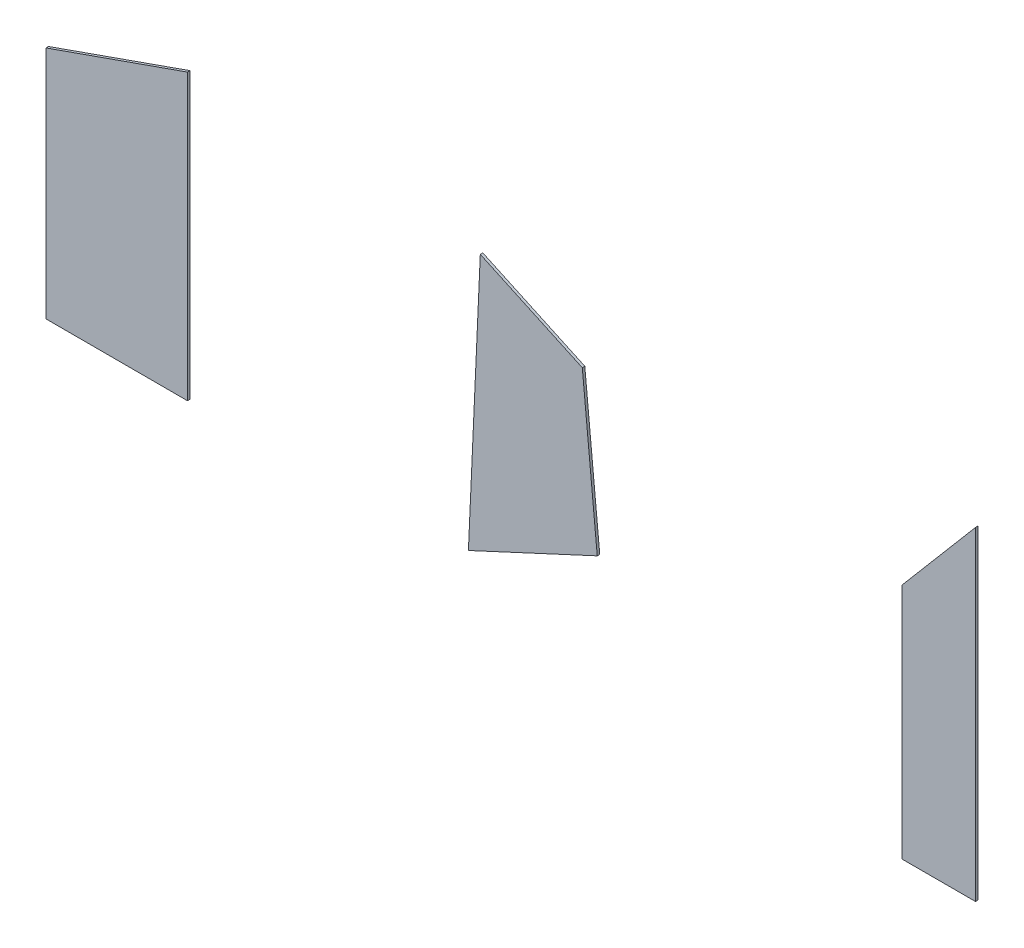
ISO-10303-21;
HEADER;
FILE_DESCRIPTION(('STEP AP214'),'2;1');
FILE_NAME('part.step','',(''),(''),'','','');
FILE_SCHEMA(('AUTOMOTIVE_DESIGN { 1 0 10303 214 1 1 1 1 }'));
ENDSEC;
DATA;
#1=APPLICATION_CONTEXT('core data for automotive mechanical design processes');
#2=APPLICATION_PROTOCOL_DEFINITION('international standard','automotive_design',2000,#1);
#3=PRODUCT_CONTEXT('',#1,'mechanical');
#4=PRODUCT('Part','Part','',(#3));
#5=PRODUCT_RELATED_PRODUCT_CATEGORY('part','',(#4));
#6=PRODUCT_DEFINITION_FORMATION('','',#4);
#7=PRODUCT_DEFINITION_CONTEXT('part definition',#1,'design');
#8=PRODUCT_DEFINITION('design','',#6,#7);
#9=PRODUCT_DEFINITION_SHAPE('','',#8);
#10=(LENGTH_UNIT() NAMED_UNIT(*) SI_UNIT(.MILLI.,.METRE.));
#11=(NAMED_UNIT(*) PLANE_ANGLE_UNIT() SI_UNIT($,.RADIAN.));
#12=(NAMED_UNIT(*) SI_UNIT($,.STERADIAN.) SOLID_ANGLE_UNIT());
#13=UNCERTAINTY_MEASURE_WITH_UNIT(LENGTH_MEASURE(1.E-05),#10,'distance_accuracy_value','');
#14=(GEOMETRIC_REPRESENTATION_CONTEXT(3) GLOBAL_UNCERTAINTY_ASSIGNED_CONTEXT((#13)) GLOBAL_UNIT_ASSIGNED_CONTEXT((#10,
#11,#12)) REPRESENTATION_CONTEXT('',''));
#15=CARTESIAN_POINT('',(0.,0.,0.));
#16=DIRECTION('',(0.,0.,1.));
#17=DIRECTION('',(1.,0.,0.));
#18=AXIS2_PLACEMENT_3D('',#15,#16,#17);
#19=CARTESIAN_POINT('',(-7769.56070517788,-24266.909097047,12.));
#20=DIRECTION('',(0.762554745675357,-0.646923689354464,0.));
#21=DIRECTION('',(0.646923689354464,0.762554745675357,0.));
#22=AXIS2_PLACEMENT_3D('',#19,#20,#21);
#23=PLANE('',#22);
#24=DIRECTION('',(-0.646923689354464,-0.762554745675357,0.));
#25=VECTOR('',#24,1.);
#26=CARTESIAN_POINT('',(-7769.56070517788,-24266.909097047,0.));
#27=LINE('',#26,#25);
#28=CARTESIAN_POINT('',(-7769.56070517788,-24266.909097047,0.));
#29=VERTEX_POINT('',#28);
#30=CARTESIAN_POINT('',(-8121.56633920693,-24681.8321724428,0.));
#31=VERTEX_POINT('',#30);
#32=EDGE_CURVE('E130',#29,#31,#27,.T.);
#33=ORIENTED_EDGE('',*,*,#32,.T.);
#34=DIRECTION('',(0.,0.,-1.));
#35=VECTOR('',#34,1.);
#36=CARTESIAN_POINT('',(-8121.56633920693,-24681.8321724428,12.));
#37=LINE('',#36,#35);
#38=CARTESIAN_POINT('',(-8121.56633920693,-24681.8321724428,12.));
#39=VERTEX_POINT('',#38);
#40=EDGE_CURVE('E13',#39,#31,#37,.T.);
#41=ORIENTED_EDGE('',*,*,#40,.F.);
#42=DIRECTION('',(-0.646923689354464,-0.762554745675357,0.));
#43=VECTOR('',#42,1.);
#44=CARTESIAN_POINT('',(-7769.56070517788,-24266.909097047,12.));
#45=LINE('',#44,#43);
#46=CARTESIAN_POINT('',(-7769.56070517788,-24266.909097047,12.));
#47=VERTEX_POINT('',#46);
#48=EDGE_CURVE('E99',#47,#39,#45,.T.);
#49=ORIENTED_EDGE('',*,*,#48,.F.);
#50=DIRECTION('',(0.,0.,-1.));
#51=VECTOR('',#50,1.);
#52=CARTESIAN_POINT('',(-7769.56070517788,-24266.909097047,12.));
#53=LINE('',#52,#51);
#54=EDGE_CURVE('E110',#47,#29,#53,.T.);
#55=ORIENTED_EDGE('',*,*,#54,.T.);
#56=EDGE_LOOP('',(#33,#41,#49,#55));
#57=FACE_BOUND('',#56,.T.);
#58=ADVANCED_FACE('F48',(#57),#23,.F.);
#59=CARTESIAN_POINT('',(-8121.56633920693,-24681.8321724428,12.));
#60=DIRECTION('',(0.999999999693778,-2.4747614261289E-05,0.));
#61=DIRECTION('',(2.4747614261289E-05,0.999999999693778,0.));
#62=AXIS2_PLACEMENT_3D('',#59,#60,#61);
#63=PLANE('',#62);
#64=DIRECTION('',(-2.4747614261289E-05,-0.999999999693778,0.));
#65=VECTOR('',#64,1.);
#66=CARTESIAN_POINT('',(-8121.56633920693,-24681.8321724428,0.));
#67=LINE('',#66,#65);
#68=CARTESIAN_POINT('',(-8121.59447702968,-25818.823497743,0.));
#69=VERTEX_POINT('',#68);
#70=EDGE_CURVE('E104',#31,#69,#67,.T.);
#71=ORIENTED_EDGE('',*,*,#70,.T.);
#72=DIRECTION('',(0.,0.,-1.));
#73=VECTOR('',#72,1.);
#74=CARTESIAN_POINT('',(-8121.59447702968,-25818.823497743,12.));
#75=LINE('',#74,#73);
#76=CARTESIAN_POINT('',(-8121.59447702968,-25818.823497743,12.));
#77=VERTEX_POINT('',#76);
#78=EDGE_CURVE('E56',#77,#69,#75,.T.);
#79=ORIENTED_EDGE('',*,*,#78,.F.);
#80=DIRECTION('',(-2.4747614261289E-05,-0.999999999693778,0.));
#81=VECTOR('',#80,1.);
#82=CARTESIAN_POINT('',(-8121.56633920693,-24681.8321724428,12.));
#83=LINE('',#82,#81);
#84=EDGE_CURVE('E94',#39,#77,#83,.T.);
#85=ORIENTED_EDGE('',*,*,#84,.F.);
#86=ORIENTED_EDGE('',*,*,#40,.T.);
#87=EDGE_LOOP('',(#71,#79,#85,#86));
#88=FACE_BOUND('',#87,.T.);
#89=ADVANCED_FACE('F103',(#88),#63,.F.);
#90=CARTESIAN_POINT('',(-7769.61363602575,-25818.845017714,12.));
#91=DIRECTION('',(6.11396090221634E-05,0.999999998130974,0.));
#92=DIRECTION('',(-0.999999998130974,6.11396090221635E-05,0.));
#93=AXIS2_PLACEMENT_3D('',#90,#91,#92);
#94=PLANE('',#93);
#95=DIRECTION('',(0.999999998130974,-6.11396090221634E-05,0.));
#96=VECTOR('',#95,1.);
#97=CARTESIAN_POINT('',(-7769.61363602575,-25818.845017714,0.));
#98=LINE('',#97,#96);
#99=CARTESIAN_POINT('',(-7769.61363602575,-25818.845017714,0.));
#100=VERTEX_POINT('',#99);
#101=EDGE_CURVE('E81',#69,#100,#98,.T.);
#102=ORIENTED_EDGE('',*,*,#101,.T.);
#103=DIRECTION('',(0.,0.,-1.));
#104=VECTOR('',#103,1.);
#105=CARTESIAN_POINT('',(-7769.61363602575,-25818.845017714,12.));
#106=LINE('',#105,#104);
#107=CARTESIAN_POINT('',(-7769.61363602575,-25818.845017714,12.));
#108=VERTEX_POINT('',#107);
#109=EDGE_CURVE('E105',#108,#100,#106,.T.);
#110=ORIENTED_EDGE('',*,*,#109,.F.);
#111=DIRECTION('',(0.999999998130974,-6.11396090221634E-05,0.));
#112=VECTOR('',#111,1.);
#113=CARTESIAN_POINT('',(-7769.61363602575,-25818.845017714,12.));
#114=LINE('',#113,#112);
#115=EDGE_CURVE('E97',#77,#108,#114,.T.);
#116=ORIENTED_EDGE('',*,*,#115,.F.);
#117=ORIENTED_EDGE('',*,*,#78,.T.);
#118=EDGE_LOOP('',(#102,#110,#116,#117));
#119=FACE_BOUND('',#118,.T.);
#120=ADVANCED_FACE('F106',(#119),#94,.F.);
#121=CARTESIAN_POINT('',(-7769.56070517788,-24266.909097047,12.));
#122=DIRECTION('',(-0.999999999418379,3.41063359182995E-05,0.));
#123=DIRECTION('',(-3.41063359182995E-05,-0.999999999418379,0.));
#124=AXIS2_PLACEMENT_3D('',#121,#122,#123);
#125=PLANE('',#124);
#126=DIRECTION('',(3.41063359182995E-05,0.999999999418379,0.));
#127=VECTOR('',#126,1.);
#128=CARTESIAN_POINT('',(-7769.56070517788,-24266.909097047,0.));
#129=LINE('',#128,#127);
#130=EDGE_CURVE('E87',#100,#29,#129,.T.);
#131=ORIENTED_EDGE('',*,*,#130,.T.);
#132=ORIENTED_EDGE('',*,*,#54,.F.);
#133=DIRECTION('',(3.41063359182995E-05,0.999999999418379,0.));
#134=VECTOR('',#133,1.);
#135=CARTESIAN_POINT('',(-7769.56070517788,-24266.909097047,12.));
#136=LINE('',#135,#134);
#137=EDGE_CURVE('E64',#108,#47,#136,.T.);
#138=ORIENTED_EDGE('',*,*,#137,.F.);
#139=ORIENTED_EDGE('',*,*,#109,.T.);
#140=EDGE_LOOP('',(#131,#132,#138,#139));
#141=FACE_BOUND('',#140,.T.);
#142=ADVANCED_FACE('F125',(#141),#125,.F.);
#143=CARTESIAN_POINT('',(0.,0.,12.));
#144=DIRECTION('',(0.,0.,-1.));
#145=DIRECTION('',(-1.,0.,0.));
#146=AXIS2_PLACEMENT_3D('',#143,#144,#145);
#147=PLANE('',#146);
#148=ORIENTED_EDGE('',*,*,#48,.T.);
#149=ORIENTED_EDGE('',*,*,#84,.T.);
#150=ORIENTED_EDGE('',*,*,#115,.T.);
#151=ORIENTED_EDGE('',*,*,#137,.T.);
#152=EDGE_LOOP('',(#148,#149,#150,#151));
#153=FACE_BOUND('',#152,.T.);
#154=ADVANCED_FACE('F95',(#153),#147,.F.);
#155=CARTESIAN_POINT('',(0.,0.,0.));
#156=DIRECTION('',(0.,0.,-1.));
#157=DIRECTION('',(-1.,0.,0.));
#158=AXIS2_PLACEMENT_3D('',#155,#156,#157);
#159=PLANE('',#158);
#160=ORIENTED_EDGE('',*,*,#32,.F.);
#161=ORIENTED_EDGE('',*,*,#130,.F.);
#162=ORIENTED_EDGE('',*,*,#101,.F.);
#163=ORIENTED_EDGE('',*,*,#70,.F.);
#164=EDGE_LOOP('',(#160,#161,#162,#163));
#165=FACE_BOUND('',#164,.T.);
#166=ADVANCED_FACE('F128',(#165),#159,.T.);
#167=CLOSED_SHELL('',(#58,#89,#120,#142,#154,#166));
#168=MANIFOLD_SOLID_BREP('B2',#167);
#169=CARTESIAN_POINT('',(-9653.25087847624,-24545.8473922626,12.));
#170=DIRECTION('',(-0.419507370487163,-0.907751929828269,0.));
#171=DIRECTION('',(0.907751929828269,-0.419507370487163,0.));
#172=AXIS2_PLACEMENT_3D('',#169,#170,#171);
#173=PLANE('',#172);
#174=DIRECTION('',(-0.907751929828269,0.419507370487163,0.));
#175=VECTOR('',#174,1.);
#176=CARTESIAN_POINT('',(-9653.25087847624,-24545.8473922626,0.));
#177=LINE('',#176,#175);
#178=CARTESIAN_POINT('',(-9653.25087847624,-24545.8473922626,0.));
#179=VERTEX_POINT('',#178);
#180=CARTESIAN_POINT('',(-10141.8988908015,-24320.0241954085,0.));
#181=VERTEX_POINT('',#180);
#182=EDGE_CURVE('E275',#179,#181,#177,.T.);
#183=ORIENTED_EDGE('',*,*,#182,.T.);
#184=DIRECTION('',(0.,0.,-1.));
#185=VECTOR('',#184,1.);
#186=CARTESIAN_POINT('',(-10141.8988908015,-24320.0241954085,12.));
#187=LINE('',#186,#185);
#188=CARTESIAN_POINT('',(-10141.8988908015,-24320.0241954085,12.));
#189=VERTEX_POINT('',#188);
#190=EDGE_CURVE('E46',#189,#181,#187,.T.);
#191=ORIENTED_EDGE('',*,*,#190,.F.);
#192=DIRECTION('',(-0.907751929828269,0.419507370487163,0.));
#193=VECTOR('',#192,1.);
#194=CARTESIAN_POINT('',(-9653.25087847624,-24545.8473922626,12.));
#195=LINE('',#194,#193);
#196=CARTESIAN_POINT('',(-9653.25087847624,-24545.8473922626,12.));
#197=VERTEX_POINT('',#196);
#198=EDGE_CURVE('E244',#197,#189,#195,.T.);
#199=ORIENTED_EDGE('',*,*,#198,.F.);
#200=DIRECTION('',(0.,0.,-1.));
#201=VECTOR('',#200,1.);
#202=CARTESIAN_POINT('',(-9653.25087847624,-24545.8473922626,12.));
#203=LINE('',#202,#201);
#204=EDGE_CURVE('E255',#197,#179,#203,.T.);
#205=ORIENTED_EDGE('',*,*,#204,.T.);
#206=EDGE_LOOP('',(#183,#191,#199,#205));
#207=FACE_BOUND('',#206,.T.);
#208=ADVANCED_FACE('F193',(#207),#173,.F.);
#209=CARTESIAN_POINT('',(-10141.8988908015,-24320.0241954085,12.));
#210=DIRECTION('',(0.998974485017721,-0.0452766858723053,0.));
#211=DIRECTION('',(0.0452766858723053,0.998974485017721,0.));
#212=AXIS2_PLACEMENT_3D('',#209,#210,#211);
#213=PLANE('',#212);
#214=DIRECTION('',(-0.0452766858723053,-0.998974485017721,0.));
#215=VECTOR('',#214,1.);
#216=CARTESIAN_POINT('',(-10141.8988908015,-24320.0241954085,0.));
#217=LINE('',#216,#215);
#218=CARTESIAN_POINT('',(-10198.8762879276,-25577.1605086142,0.));
#219=VERTEX_POINT('',#218);
#220=EDGE_CURVE('E249',#181,#219,#217,.T.);
#221=ORIENTED_EDGE('',*,*,#220,.T.);
#222=DIRECTION('',(0.,0.,-1.));
#223=VECTOR('',#222,1.);
#224=CARTESIAN_POINT('',(-10198.8762879276,-25577.1605086142,12.));
#225=LINE('',#224,#223);
#226=CARTESIAN_POINT('',(-10198.8762879276,-25577.1605086142,12.));
#227=VERTEX_POINT('',#226);
#228=EDGE_CURVE('E201',#227,#219,#225,.T.);
#229=ORIENTED_EDGE('',*,*,#228,.F.);
#230=DIRECTION('',(-0.0452766858723053,-0.998974485017721,0.));
#231=VECTOR('',#230,1.);
#232=CARTESIAN_POINT('',(-10141.8988908015,-24320.0241954085,12.));
#233=LINE('',#232,#231);
#234=EDGE_CURVE('E239',#189,#227,#233,.T.);
#235=ORIENTED_EDGE('',*,*,#234,.F.);
#236=ORIENTED_EDGE('',*,*,#190,.T.);
#237=EDGE_LOOP('',(#221,#229,#235,#236));
#238=FACE_BOUND('',#237,.T.);
#239=ADVANCED_FACE('F248',(#238),#213,.F.);
#240=CARTESIAN_POINT('',(-10198.8762879276,-25577.1605086142,12.));
#241=DIRECTION('',(-0.420821286159563,0.907143563673915,0.));
#242=DIRECTION('',(-0.907143563673915,-0.420821286159563,0.));
#243=AXIS2_PLACEMENT_3D('',#240,#241,#242);
#244=PLANE('',#243);
#245=DIRECTION('',(0.907143563673915,0.420821286159563,0.));
#246=VECTOR('',#245,1.);
#247=CARTESIAN_POINT('',(-10198.8762879276,-25577.1605086142,0.));
#248=LINE('',#247,#246);
#249=CARTESIAN_POINT('',(-9581.69225761938,-25290.850614754,0.));
#250=VERTEX_POINT('',#249);
#251=EDGE_CURVE('E226',#219,#250,#248,.T.);
#252=ORIENTED_EDGE('',*,*,#251,.T.);
#253=DIRECTION('',(0.,0.,-1.));
#254=VECTOR('',#253,1.);
#255=CARTESIAN_POINT('',(-9581.69225761938,-25290.850614754,12.));
#256=LINE('',#255,#254);
#257=CARTESIAN_POINT('',(-9581.69225761938,-25290.850614754,12.));
#258=VERTEX_POINT('',#257);
#259=EDGE_CURVE('E250',#258,#250,#256,.T.);
#260=ORIENTED_EDGE('',*,*,#259,.F.);
#261=DIRECTION('',(0.907143563673915,0.420821286159563,0.));
#262=VECTOR('',#261,1.);
#263=CARTESIAN_POINT('',(-10198.8762879276,-25577.1605086142,12.));
#264=LINE('',#263,#262);
#265=EDGE_CURVE('E242',#227,#258,#264,.T.);
#266=ORIENTED_EDGE('',*,*,#265,.F.);
#267=ORIENTED_EDGE('',*,*,#228,.T.);
#268=EDGE_LOOP('',(#252,#260,#266,#267));
#269=FACE_BOUND('',#268,.T.);
#270=ADVANCED_FACE('F251',(#269),#244,.F.);
#271=CARTESIAN_POINT('',(-9653.25087847624,-24545.8473922626,12.));
#272=DIRECTION('',(-0.995418737277823,-0.0956113877957187,0.));
#273=DIRECTION('',(0.0956113877957187,-0.995418737277824,0.));
#274=AXIS2_PLACEMENT_3D('',#271,#272,#273);
#275=PLANE('',#274);
#276=DIRECTION('',(-0.0956113877957187,0.995418737277824,0.));
#277=VECTOR('',#276,1.);
#278=CARTESIAN_POINT('',(-9653.25087847624,-24545.8473922626,0.));
#279=LINE('',#278,#277);
#280=EDGE_CURVE('E232',#250,#179,#279,.T.);
#281=ORIENTED_EDGE('',*,*,#280,.T.);
#282=ORIENTED_EDGE('',*,*,#204,.F.);
#283=DIRECTION('',(-0.0956113877957187,0.995418737277824,0.));
#284=VECTOR('',#283,1.);
#285=CARTESIAN_POINT('',(-9653.25087847624,-24545.8473922626,12.));
#286=LINE('',#285,#284);
#287=EDGE_CURVE('E209',#258,#197,#286,.T.);
#288=ORIENTED_EDGE('',*,*,#287,.F.);
#289=ORIENTED_EDGE('',*,*,#259,.T.);
#290=EDGE_LOOP('',(#281,#282,#288,#289));
#291=FACE_BOUND('',#290,.T.);
#292=ADVANCED_FACE('F270',(#291),#275,.F.);
#293=CARTESIAN_POINT('',(0.,0.,12.));
#294=DIRECTION('',(0.,0.,1.));
#295=DIRECTION('',(1.,0.,0.));
#296=AXIS2_PLACEMENT_3D('',#293,#294,#295);
#297=PLANE('',#296);
#298=ORIENTED_EDGE('',*,*,#198,.T.);
#299=ORIENTED_EDGE('',*,*,#234,.T.);
#300=ORIENTED_EDGE('',*,*,#265,.T.);
#301=ORIENTED_EDGE('',*,*,#287,.T.);
#302=EDGE_LOOP('',(#298,#299,#300,#301));
#303=FACE_BOUND('',#302,.T.);
#304=ADVANCED_FACE('F240',(#303),#297,.T.);
#305=CARTESIAN_POINT('',(0.,0.,0.));
#306=DIRECTION('',(0.,0.,1.));
#307=DIRECTION('',(1.,0.,0.));
#308=AXIS2_PLACEMENT_3D('',#305,#306,#307);
#309=PLANE('',#308);
#310=ORIENTED_EDGE('',*,*,#182,.F.);
#311=ORIENTED_EDGE('',*,*,#280,.F.);
#312=ORIENTED_EDGE('',*,*,#251,.F.);
#313=ORIENTED_EDGE('',*,*,#220,.F.);
#314=EDGE_LOOP('',(#310,#311,#312,#313));
#315=FACE_BOUND('',#314,.T.);
#316=ADVANCED_FACE('F273',(#315),#309,.F.);
#317=CLOSED_SHELL('',(#208,#239,#270,#292,#304,#316));
#318=MANIFOLD_SOLID_BREP('B7',#317);
#319=CARTESIAN_POINT('',(-12222.5469666218,-25628.1544357183,12.));
#320=DIRECTION('',(0.00100471306423313,0.999999495275702,0.));
#321=DIRECTION('',(-0.999999495275702,0.00100471306423313,0.));
#322=AXIS2_PLACEMENT_3D('',#319,#320,#321);
#323=PLANE('',#322);
#324=DIRECTION('',(0.999999495275702,-0.00100471306423313,0.));
#325=VECTOR('',#324,1.);
#326=CARTESIAN_POINT('',(-12222.5469666218,-25628.1544357183,0.));
#327=LINE('',#326,#325);
#328=CARTESIAN_POINT('',(-12222.5469666218,-25628.1544357183,0.));
#329=VERTEX_POINT('',#328);
#330=CARTESIAN_POINT('',(-11544.7756917224,-25628.8354017165,0.));
#331=VERTEX_POINT('',#330);
#332=EDGE_CURVE('E410',#329,#331,#327,.T.);
#333=ORIENTED_EDGE('',*,*,#332,.T.);
#334=DIRECTION('',(0.,0.,-1.));
#335=VECTOR('',#334,1.);
#336=CARTESIAN_POINT('',(-11544.7756917224,-25628.8354017165,12.));
#337=LINE('',#336,#335);
#338=CARTESIAN_POINT('',(-11544.7756917224,-25628.8354017165,12.));
#339=VERTEX_POINT('',#338);
#340=EDGE_CURVE('E191',#339,#331,#337,.T.);
#341=ORIENTED_EDGE('',*,*,#340,.F.);
#342=DIRECTION('',(0.999999495275702,-0.00100471306423313,0.));
#343=VECTOR('',#342,1.);
#344=CARTESIAN_POINT('',(-12222.5469666218,-25628.1544357183,12.));
#345=LINE('',#344,#343);
#346=CARTESIAN_POINT('',(-12222.5469666218,-25628.1544357183,12.));
#347=VERTEX_POINT('',#346);
#348=EDGE_CURVE('E379',#347,#339,#345,.T.);
#349=ORIENTED_EDGE('',*,*,#348,.F.);
#350=DIRECTION('',(0.,0.,-1.));
#351=VECTOR('',#350,1.);
#352=CARTESIAN_POINT('',(-12222.5469666218,-25628.1544357183,12.));
#353=LINE('',#352,#351);
#354=EDGE_CURVE('E390',#347,#329,#353,.T.);
#355=ORIENTED_EDGE('',*,*,#354,.T.);
#356=EDGE_LOOP('',(#333,#341,#349,#355));
#357=FACE_BOUND('',#356,.T.);
#358=ADVANCED_FACE('F328',(#357),#323,.F.);
#359=CARTESIAN_POINT('',(-11544.7634325376,-24265.1754631127,12.));
#360=DIRECTION('',(-0.999999999959591,8.98991340372003E-06,0.));
#361=DIRECTION('',(-8.98991340372003E-06,-0.999999999959591,0.));
#362=AXIS2_PLACEMENT_3D('',#359,#360,#361);
#363=PLANE('',#362);
#364=DIRECTION('',(8.98991340372003E-06,0.999999999959591,0.));
#365=VECTOR('',#364,1.);
#366=CARTESIAN_POINT('',(-11544.7634325376,-24265.1754631127,0.));
#367=LINE('',#366,#365);
#368=CARTESIAN_POINT('',(-11544.7634325376,-24265.1754631127,0.));
#369=VERTEX_POINT('',#368);
#370=EDGE_CURVE('E384',#331,#369,#367,.T.);
#371=ORIENTED_EDGE('',*,*,#370,.T.);
#372=DIRECTION('',(0.,0.,-1.));
#373=VECTOR('',#372,1.);
#374=CARTESIAN_POINT('',(-11544.7634325376,-24265.1754631127,12.));
#375=LINE('',#374,#373);
#376=CARTESIAN_POINT('',(-11544.7634325376,-24265.1754631127,12.));
#377=VERTEX_POINT('',#376);
#378=EDGE_CURVE('E336',#377,#369,#375,.T.);
#379=ORIENTED_EDGE('',*,*,#378,.F.);
#380=DIRECTION('',(8.98991340372003E-06,0.999999999959591,0.));
#381=VECTOR('',#380,1.);
#382=CARTESIAN_POINT('',(-11544.7634325376,-24265.1754631127,12.));
#383=LINE('',#382,#381);
#384=EDGE_CURVE('E374',#339,#377,#383,.T.);
#385=ORIENTED_EDGE('',*,*,#384,.F.);
#386=ORIENTED_EDGE('',*,*,#340,.T.);
#387=EDGE_LOOP('',(#371,#379,#385,#386));
#388=FACE_BOUND('',#387,.T.);
#389=ADVANCED_FACE('F383',(#388),#363,.F.);
#390=CARTESIAN_POINT('',(-11544.7634325376,-24265.1754631127,12.));
#391=DIRECTION('',(0.332225725847627,-0.943199908335989,0.));
#392=DIRECTION('',(0.943199908335989,0.332225725847627,0.));
#393=AXIS2_PLACEMENT_3D('',#390,#391,#392);
#394=PLANE('',#393);
#395=DIRECTION('',(-0.943199908335989,-0.332225725847627,0.));
#396=VECTOR('',#395,1.);
#397=CARTESIAN_POINT('',(-11544.7634325376,-24265.1754631127,0.));
#398=LINE('',#397,#396);
#399=CARTESIAN_POINT('',(-12222.526758536,-24503.9057799232,0.));
#400=VERTEX_POINT('',#399);
#401=EDGE_CURVE('E361',#369,#400,#398,.T.);
#402=ORIENTED_EDGE('',*,*,#401,.T.);
#403=DIRECTION('',(0.,0.,-1.));
#404=VECTOR('',#403,1.);
#405=CARTESIAN_POINT('',(-12222.526758536,-24503.9057799232,12.));
#406=LINE('',#405,#404);
#407=CARTESIAN_POINT('',(-12222.526758536,-24503.9057799232,12.));
#408=VERTEX_POINT('',#407);
#409=EDGE_CURVE('E385',#408,#400,#406,.T.);
#410=ORIENTED_EDGE('',*,*,#409,.F.);
#411=DIRECTION('',(-0.943199908335989,-0.332225725847627,0.));
#412=VECTOR('',#411,1.);
#413=CARTESIAN_POINT('',(-11544.7634325376,-24265.1754631127,12.));
#414=LINE('',#413,#412);
#415=EDGE_CURVE('E377',#377,#408,#414,.T.);
#416=ORIENTED_EDGE('',*,*,#415,.F.);
#417=ORIENTED_EDGE('',*,*,#378,.T.);
#418=EDGE_LOOP('',(#402,#410,#416,#417));
#419=FACE_BOUND('',#418,.T.);
#420=ADVANCED_FACE('F386',(#419),#394,.F.);
#421=CARTESIAN_POINT('',(-12222.5469666218,-25628.1544357183,12.));
#422=DIRECTION('',(0.999999999838454,-1.79747476154928E-05,0.));
#423=DIRECTION('',(1.79747476154928E-05,0.999999999838454,0.));
#424=AXIS2_PLACEMENT_3D('',#421,#422,#423);
#425=PLANE('',#424);
#426=DIRECTION('',(-1.79747476154928E-05,-0.999999999838454,0.));
#427=VECTOR('',#426,1.);
#428=CARTESIAN_POINT('',(-12222.5469666218,-25628.1544357183,0.));
#429=LINE('',#428,#427);
#430=EDGE_CURVE('E367',#400,#329,#429,.T.);
#431=ORIENTED_EDGE('',*,*,#430,.T.);
#432=ORIENTED_EDGE('',*,*,#354,.F.);
#433=DIRECTION('',(-1.79747476154928E-05,-0.999999999838454,0.));
#434=VECTOR('',#433,1.);
#435=CARTESIAN_POINT('',(-12222.5469666218,-25628.1544357183,12.));
#436=LINE('',#435,#434);
#437=EDGE_CURVE('E344',#408,#347,#436,.T.);
#438=ORIENTED_EDGE('',*,*,#437,.F.);
#439=ORIENTED_EDGE('',*,*,#409,.T.);
#440=EDGE_LOOP('',(#431,#432,#438,#439));
#441=FACE_BOUND('',#440,.T.);
#442=ADVANCED_FACE('F405',(#441),#425,.F.);
#443=CARTESIAN_POINT('',(0.,0.,12.));
#444=DIRECTION('',(0.,0.,1.));
#445=DIRECTION('',(1.,0.,0.));
#446=AXIS2_PLACEMENT_3D('',#443,#444,#445);
#447=PLANE('',#446);
#448=ORIENTED_EDGE('',*,*,#348,.T.);
#449=ORIENTED_EDGE('',*,*,#384,.T.);
#450=ORIENTED_EDGE('',*,*,#415,.T.);
#451=ORIENTED_EDGE('',*,*,#437,.T.);
#452=EDGE_LOOP('',(#448,#449,#450,#451));
#453=FACE_BOUND('',#452,.T.);
#454=ADVANCED_FACE('F375',(#453),#447,.T.);
#455=CARTESIAN_POINT('',(0.,0.,0.));
#456=DIRECTION('',(0.,0.,1.));
#457=DIRECTION('',(1.,0.,0.));
#458=AXIS2_PLACEMENT_3D('',#455,#456,#457);
#459=PLANE('',#458);
#460=ORIENTED_EDGE('',*,*,#332,.F.);
#461=ORIENTED_EDGE('',*,*,#430,.F.);
#462=ORIENTED_EDGE('',*,*,#401,.F.);
#463=ORIENTED_EDGE('',*,*,#370,.F.);
#464=EDGE_LOOP('',(#460,#461,#462,#463));
#465=FACE_BOUND('',#464,.T.);
#466=ADVANCED_FACE('F408',(#465),#459,.F.);
#467=CLOSED_SHELL('',(#358,#389,#420,#442,#454,#466));
#468=MANIFOLD_SOLID_BREP('B40',#467);
#469=ADVANCED_BREP_SHAPE_REPRESENTATION('',(#18,#168,#318,#468),#14);
#470=SHAPE_DEFINITION_REPRESENTATION(#9,#469);
ENDSEC;
END-ISO-10303-21;
